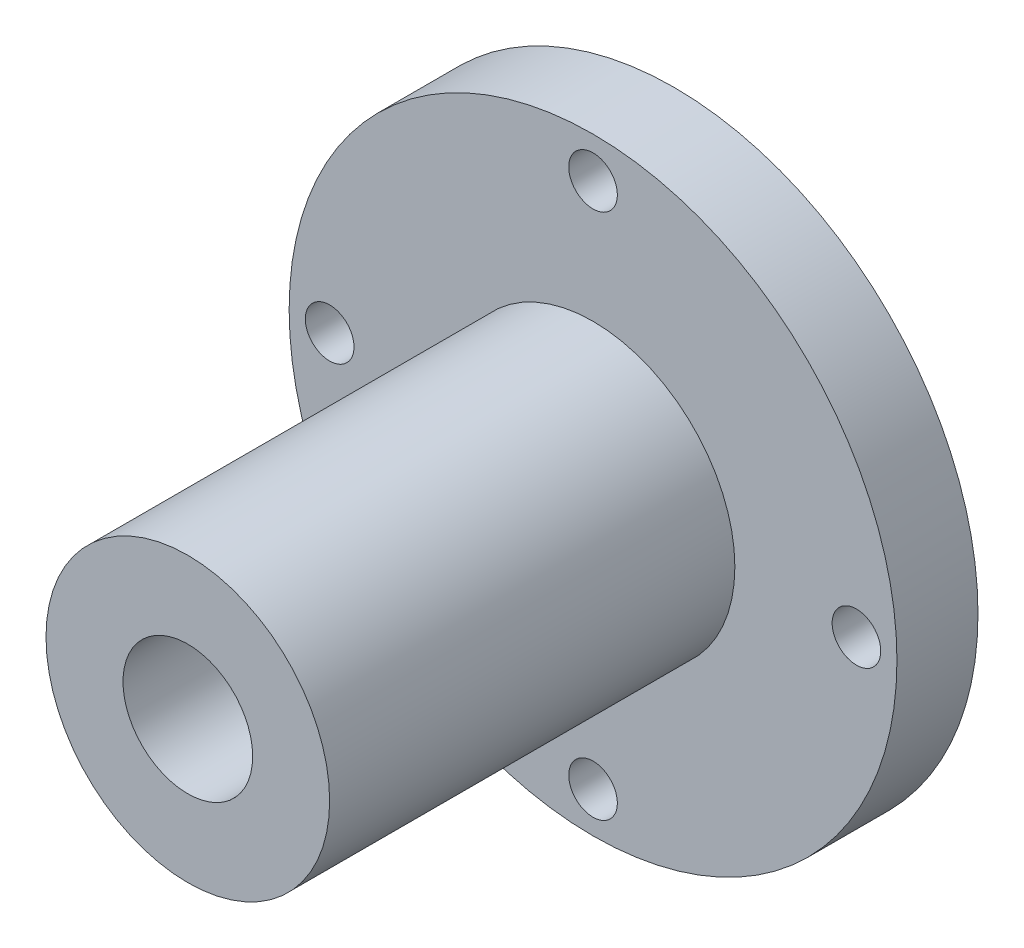
ISO-10303-21;
HEADER;
FILE_DESCRIPTION(('STEP AP214'),'2;1');
FILE_NAME('part.step','',(''),(''),'','','');
FILE_SCHEMA(('AUTOMOTIVE_DESIGN { 1 0 10303 214 1 1 1 1 }'));
ENDSEC;
DATA;
#1=APPLICATION_CONTEXT('core data for automotive mechanical design processes');
#2=APPLICATION_PROTOCOL_DEFINITION('international standard','automotive_design',2000,#1);
#3=PRODUCT_CONTEXT('',#1,'mechanical');
#4=PRODUCT('Part','Part','',(#3));
#5=PRODUCT_RELATED_PRODUCT_CATEGORY('part','',(#4));
#6=PRODUCT_DEFINITION_FORMATION('','',#4);
#7=PRODUCT_DEFINITION_CONTEXT('part definition',#1,'design');
#8=PRODUCT_DEFINITION('design','',#6,#7);
#9=PRODUCT_DEFINITION_SHAPE('','',#8);
#10=(LENGTH_UNIT() NAMED_UNIT(*) SI_UNIT(.MILLI.,.METRE.));
#11=(NAMED_UNIT(*) PLANE_ANGLE_UNIT() SI_UNIT($,.RADIAN.));
#12=(NAMED_UNIT(*) SI_UNIT($,.STERADIAN.) SOLID_ANGLE_UNIT());
#13=UNCERTAINTY_MEASURE_WITH_UNIT(LENGTH_MEASURE(1.E-05),#10,'distance_accuracy_value','');
#14=(GEOMETRIC_REPRESENTATION_CONTEXT(3) GLOBAL_UNCERTAINTY_ASSIGNED_CONTEXT((#13)) GLOBAL_UNIT_ASSIGNED_CONTEXT((#10,
#11,#12)) REPRESENTATION_CONTEXT('',''));
#15=CARTESIAN_POINT('',(0.,0.,0.));
#16=DIRECTION('',(0.,0.,1.));
#17=DIRECTION('',(1.,0.,0.));
#18=AXIS2_PLACEMENT_3D('',#15,#16,#17);
#19=CARTESIAN_POINT('',(0.,0.,10.));
#20=DIRECTION('',(0.,0.,-1.));
#21=DIRECTION('',(-1.,0.,0.));
#22=AXIS2_PLACEMENT_3D('',#19,#20,#21);
#23=CYLINDRICAL_SURFACE('',#22,37.5);
#24=CARTESIAN_POINT('',(0.,0.,10.));
#25=DIRECTION('',(0.,0.,1.));
#26=DIRECTION('',(1.,0.,0.));
#27=AXIS2_PLACEMENT_3D('',#24,#25,#26);
#28=CIRCLE('',#27,37.5);
#29=CARTESIAN_POINT('',(37.5,0.,10.));
#30=VERTEX_POINT('',#29);
#31=EDGE_CURVE('E45',#30,#30,#28,.T.);
#32=ORIENTED_EDGE('',*,*,#31,.F.);
#33=EDGE_LOOP('',(#32));
#34=FACE_BOUND('',#33,.T.);
#35=CARTESIAN_POINT('',(0.,0.,0.));
#36=DIRECTION('',(0.,0.,1.));
#37=DIRECTION('',(1.,0.,0.));
#38=AXIS2_PLACEMENT_3D('',#35,#36,#37);
#39=CIRCLE('',#38,37.5);
#40=CARTESIAN_POINT('',(37.5,0.,0.));
#41=VERTEX_POINT('',#40);
#42=EDGE_CURVE('E40',#41,#41,#39,.T.);
#43=ORIENTED_EDGE('',*,*,#42,.T.);
#44=EDGE_LOOP('',(#43));
#45=FACE_BOUND('',#44,.T.);
#46=ADVANCED_FACE('F37',(#34,#45),#23,.T.);
#47=CARTESIAN_POINT('',(0.,0.,10.));
#48=DIRECTION('',(0.,0.,1.));
#49=DIRECTION('',(1.,0.,0.));
#50=AXIS2_PLACEMENT_3D('',#47,#48,#49);
#51=PLANE('',#50);
#52=CARTESIAN_POINT('',(0.,32.5,10.));
#53=DIRECTION('',(0.,0.,1.));
#54=DIRECTION('',(1.,0.,0.));
#55=AXIS2_PLACEMENT_3D('',#52,#53,#54);
#56=CIRCLE('',#55,3.);
#57=CARTESIAN_POINT('',(3.,32.5,10.));
#58=VERTEX_POINT('',#57);
#59=EDGE_CURVE('E89',#58,#58,#56,.T.);
#60=ORIENTED_EDGE('',*,*,#59,.F.);
#61=EDGE_LOOP('',(#60));
#62=FACE_BOUND('',#61,.T.);
#63=CARTESIAN_POINT('',(32.5000000000009,9.19725454390901E-13,10.));
#64=DIRECTION('',(0.,0.,1.));
#65=DIRECTION('',(1.,0.,0.));
#66=AXIS2_PLACEMENT_3D('',#63,#64,#65);
#67=CIRCLE('',#66,3.00000000000072);
#68=CARTESIAN_POINT('',(35.5000000000016,9.19725454390901E-13,10.));
#69=VERTEX_POINT('',#68);
#70=EDGE_CURVE('E81',#69,#69,#67,.T.);
#71=ORIENTED_EDGE('',*,*,#70,.F.);
#72=EDGE_LOOP('',(#71));
#73=FACE_BOUND('',#72,.T.);
#74=CARTESIAN_POINT('',(1.8394509087818E-12,-32.5,10.));
#75=DIRECTION('',(0.,0.,1.));
#76=DIRECTION('',(1.,0.,0.));
#77=AXIS2_PLACEMENT_3D('',#74,#75,#76);
#78=CIRCLE('',#77,3.00000000000198);
#79=CARTESIAN_POINT('',(3.00000000000382,-32.5,10.));
#80=VERTEX_POINT('',#79);
#81=EDGE_CURVE('E73',#80,#80,#78,.T.);
#82=ORIENTED_EDGE('',*,*,#81,.F.);
#83=EDGE_LOOP('',(#82));
#84=FACE_BOUND('',#83,.T.);
#85=CARTESIAN_POINT('',(-32.4999999999991,-9.2370555648813E-13,10.));
#86=DIRECTION('',(0.,0.,1.));
#87=DIRECTION('',(1.,0.,0.));
#88=AXIS2_PLACEMENT_3D('',#85,#86,#87);
#89=CIRCLE('',#88,3.00000000000148);
#90=CARTESIAN_POINT('',(-29.4999999999976,-9.2370555648813E-13,10.));
#91=VERTEX_POINT('',#90);
#92=EDGE_CURVE('E65',#91,#91,#89,.T.);
#93=ORIENTED_EDGE('',*,*,#92,.F.);
#94=EDGE_LOOP('',(#93));
#95=FACE_BOUND('',#94,.T.);
#96=CARTESIAN_POINT('',(0.,0.,10.));
#97=DIRECTION('',(0.,0.,1.));
#98=DIRECTION('',(1.,0.,0.));
#99=AXIS2_PLACEMENT_3D('',#96,#97,#98);
#100=CIRCLE('',#99,17.5);
#101=CARTESIAN_POINT('',(17.5,0.,10.));
#102=VERTEX_POINT('',#101);
#103=EDGE_CURVE('E10',#102,#102,#100,.T.);
#104=ORIENTED_EDGE('',*,*,#103,.F.);
#105=EDGE_LOOP('',(#104));
#106=FACE_BOUND('',#105,.T.);
#107=ORIENTED_EDGE('',*,*,#31,.T.);
#108=EDGE_LOOP('',(#107));
#109=FACE_BOUND('',#108,.T.);
#110=ADVANCED_FACE('F107',(#62,#73,#84,#95,#106,#109),#51,.T.);
#111=CARTESIAN_POINT('',(0.,0.,0.));
#112=DIRECTION('',(0.,0.,1.));
#113=DIRECTION('',(1.,0.,0.));
#114=AXIS2_PLACEMENT_3D('',#111,#112,#113);
#115=PLANE('',#114);
#116=CARTESIAN_POINT('',(0.,32.5,0.));
#117=DIRECTION('',(0.,0.,1.));
#118=DIRECTION('',(1.,0.,0.));
#119=AXIS2_PLACEMENT_3D('',#116,#117,#118);
#120=CIRCLE('',#119,3.);
#121=CARTESIAN_POINT('',(3.,32.5,0.));
#122=VERTEX_POINT('',#121);
#123=EDGE_CURVE('E61',#122,#122,#120,.T.);
#124=ORIENTED_EDGE('',*,*,#123,.T.);
#125=EDGE_LOOP('',(#124));
#126=FACE_BOUND('',#125,.T.);
#127=CARTESIAN_POINT('',(32.5000000000009,9.19725454390901E-13,0.));
#128=DIRECTION('',(0.,0.,1.));
#129=DIRECTION('',(1.,0.,0.));
#130=AXIS2_PLACEMENT_3D('',#127,#128,#129);
#131=CIRCLE('',#130,3.00000000000072);
#132=CARTESIAN_POINT('',(35.5000000000016,9.19725454390901E-13,0.));
#133=VERTEX_POINT('',#132);
#134=EDGE_CURVE('E85',#133,#133,#131,.T.);
#135=ORIENTED_EDGE('',*,*,#134,.T.);
#136=EDGE_LOOP('',(#135));
#137=FACE_BOUND('',#136,.T.);
#138=CARTESIAN_POINT('',(1.8394509087818E-12,-32.5,0.));
#139=DIRECTION('',(0.,0.,1.));
#140=DIRECTION('',(1.,0.,0.));
#141=AXIS2_PLACEMENT_3D('',#138,#139,#140);
#142=CIRCLE('',#141,3.00000000000198);
#143=CARTESIAN_POINT('',(3.00000000000382,-32.5,0.));
#144=VERTEX_POINT('',#143);
#145=EDGE_CURVE('E77',#144,#144,#142,.T.);
#146=ORIENTED_EDGE('',*,*,#145,.T.);
#147=EDGE_LOOP('',(#146));
#148=FACE_BOUND('',#147,.T.);
#149=CARTESIAN_POINT('',(-32.4999999999991,-9.2370555648813E-13,0.));
#150=DIRECTION('',(0.,0.,1.));
#151=DIRECTION('',(1.,0.,0.));
#152=AXIS2_PLACEMENT_3D('',#149,#150,#151);
#153=CIRCLE('',#152,3.00000000000148);
#154=CARTESIAN_POINT('',(-29.4999999999976,-9.2370555648813E-13,0.));
#155=VERTEX_POINT('',#154);
#156=EDGE_CURVE('E69',#155,#155,#153,.T.);
#157=ORIENTED_EDGE('',*,*,#156,.T.);
#158=EDGE_LOOP('',(#157));
#159=FACE_BOUND('',#158,.T.);
#160=CARTESIAN_POINT('',(0.,0.,0.));
#161=DIRECTION('',(0.,0.,1.));
#162=DIRECTION('',(1.,0.,0.));
#163=AXIS2_PLACEMENT_3D('',#160,#161,#162);
#164=CIRCLE('',#163,8.);
#165=CARTESIAN_POINT('',(8.,0.,0.));
#166=VERTEX_POINT('',#165);
#167=EDGE_CURVE('E56',#166,#166,#164,.T.);
#168=ORIENTED_EDGE('',*,*,#167,.T.);
#169=EDGE_LOOP('',(#168));
#170=FACE_BOUND('',#169,.T.);
#171=ORIENTED_EDGE('',*,*,#42,.F.);
#172=EDGE_LOOP('',(#171));
#173=FACE_BOUND('',#172,.T.);
#174=ADVANCED_FACE('F97',(#126,#137,#148,#159,#170,#173),#115,.F.);
#175=CARTESIAN_POINT('',(0.,0.,60.));
#176=DIRECTION('',(0.,0.,-1.));
#177=DIRECTION('',(-1.,0.,0.));
#178=AXIS2_PLACEMENT_3D('',#175,#176,#177);
#179=CYLINDRICAL_SURFACE('',#178,17.5);
#180=CARTESIAN_POINT('',(0.,0.,60.));
#181=DIRECTION('',(0.,0.,1.));
#182=DIRECTION('',(1.,0.,0.));
#183=AXIS2_PLACEMENT_3D('',#180,#181,#182);
#184=CIRCLE('',#183,17.5);
#185=CARTESIAN_POINT('',(17.5,0.,60.));
#186=VERTEX_POINT('',#185);
#187=EDGE_CURVE('E52',#186,#186,#184,.T.);
#188=ORIENTED_EDGE('',*,*,#187,.F.);
#189=EDGE_LOOP('',(#188));
#190=FACE_BOUND('',#189,.T.);
#191=ORIENTED_EDGE('',*,*,#103,.T.);
#192=EDGE_LOOP('',(#191));
#193=FACE_BOUND('',#192,.T.);
#194=ADVANCED_FACE('F127',(#190,#193),#179,.T.);
#195=CARTESIAN_POINT('',(0.,0.,60.));
#196=DIRECTION('',(0.,0.,1.));
#197=DIRECTION('',(1.,0.,0.));
#198=AXIS2_PLACEMENT_3D('',#195,#196,#197);
#199=PLANE('',#198);
#200=CARTESIAN_POINT('',(0.,0.,60.));
#201=DIRECTION('',(0.,0.,1.));
#202=DIRECTION('',(1.,0.,0.));
#203=AXIS2_PLACEMENT_3D('',#200,#201,#202);
#204=CIRCLE('',#203,8.);
#205=CARTESIAN_POINT('',(8.,0.,60.));
#206=VERTEX_POINT('',#205);
#207=EDGE_CURVE('E57',#206,#206,#204,.T.);
#208=ORIENTED_EDGE('',*,*,#207,.F.);
#209=EDGE_LOOP('',(#208));
#210=FACE_BOUND('',#209,.T.);
#211=ORIENTED_EDGE('',*,*,#187,.T.);
#212=EDGE_LOOP('',(#211));
#213=FACE_BOUND('',#212,.T.);
#214=ADVANCED_FACE('F131',(#210,#213),#199,.T.);
#215=CARTESIAN_POINT('',(0.,0.,0.));
#216=DIRECTION('',(0.,0.,1.));
#217=DIRECTION('',(1.,0.,0.));
#218=AXIS2_PLACEMENT_3D('',#215,#216,#217);
#219=CYLINDRICAL_SURFACE('',#218,8.);
#220=ORIENTED_EDGE('',*,*,#167,.F.);
#221=EDGE_LOOP('',(#220));
#222=FACE_BOUND('',#221,.T.);
#223=ORIENTED_EDGE('',*,*,#207,.T.);
#224=EDGE_LOOP('',(#223));
#225=FACE_BOUND('',#224,.T.);
#226=ADVANCED_FACE('F137',(#222,#225),#219,.F.);
#227=CARTESIAN_POINT('',(-32.4999999999991,-9.2370555648813E-13,0.));
#228=DIRECTION('',(0.,0.,1.));
#229=DIRECTION('',(1.,0.,0.));
#230=AXIS2_PLACEMENT_3D('',#227,#228,#229);
#231=CYLINDRICAL_SURFACE('',#230,3.00000000000148);
#232=ORIENTED_EDGE('',*,*,#156,.F.);
#233=EDGE_LOOP('',(#232));
#234=FACE_BOUND('',#233,.T.);
#235=ORIENTED_EDGE('',*,*,#92,.T.);
#236=EDGE_LOOP('',(#235));
#237=FACE_BOUND('',#236,.T.);
#238=ADVANCED_FACE('F141',(#234,#237),#231,.F.);
#239=CARTESIAN_POINT('',(1.8394509087818E-12,-32.5,0.));
#240=DIRECTION('',(0.,0.,1.));
#241=DIRECTION('',(1.,0.,0.));
#242=AXIS2_PLACEMENT_3D('',#239,#240,#241);
#243=CYLINDRICAL_SURFACE('',#242,3.00000000000198);
#244=ORIENTED_EDGE('',*,*,#145,.F.);
#245=EDGE_LOOP('',(#244));
#246=FACE_BOUND('',#245,.T.);
#247=ORIENTED_EDGE('',*,*,#81,.T.);
#248=EDGE_LOOP('',(#247));
#249=FACE_BOUND('',#248,.T.);
#250=ADVANCED_FACE('F145',(#246,#249),#243,.F.);
#251=CARTESIAN_POINT('',(32.5000000000009,9.19725454390901E-13,0.));
#252=DIRECTION('',(0.,0.,1.));
#253=DIRECTION('',(1.,0.,0.));
#254=AXIS2_PLACEMENT_3D('',#251,#252,#253);
#255=CYLINDRICAL_SURFACE('',#254,3.00000000000072);
#256=ORIENTED_EDGE('',*,*,#134,.F.);
#257=EDGE_LOOP('',(#256));
#258=FACE_BOUND('',#257,.T.);
#259=ORIENTED_EDGE('',*,*,#70,.T.);
#260=EDGE_LOOP('',(#259));
#261=FACE_BOUND('',#260,.T.);
#262=ADVANCED_FACE('F103',(#258,#261),#255,.F.);
#263=CARTESIAN_POINT('',(0.,32.5,0.));
#264=DIRECTION('',(0.,0.,1.));
#265=DIRECTION('',(1.,0.,0.));
#266=AXIS2_PLACEMENT_3D('',#263,#264,#265);
#267=CYLINDRICAL_SURFACE('',#266,3.);
#268=ORIENTED_EDGE('',*,*,#123,.F.);
#269=EDGE_LOOP('',(#268));
#270=FACE_BOUND('',#269,.T.);
#271=ORIENTED_EDGE('',*,*,#59,.T.);
#272=EDGE_LOOP('',(#271));
#273=FACE_BOUND('',#272,.T.);
#274=ADVANCED_FACE('F100',(#270,#273),#267,.F.);
#275=CLOSED_SHELL('',(#46,#110,#174,#194,#214,#226,#238,#250,#262,#274));
#276=MANIFOLD_SOLID_BREP('B2',#275);
#277=ADVANCED_BREP_SHAPE_REPRESENTATION('',(#18,#276),#14);
#278=SHAPE_DEFINITION_REPRESENTATION(#9,#277);
ENDSEC;
END-ISO-10303-21;
